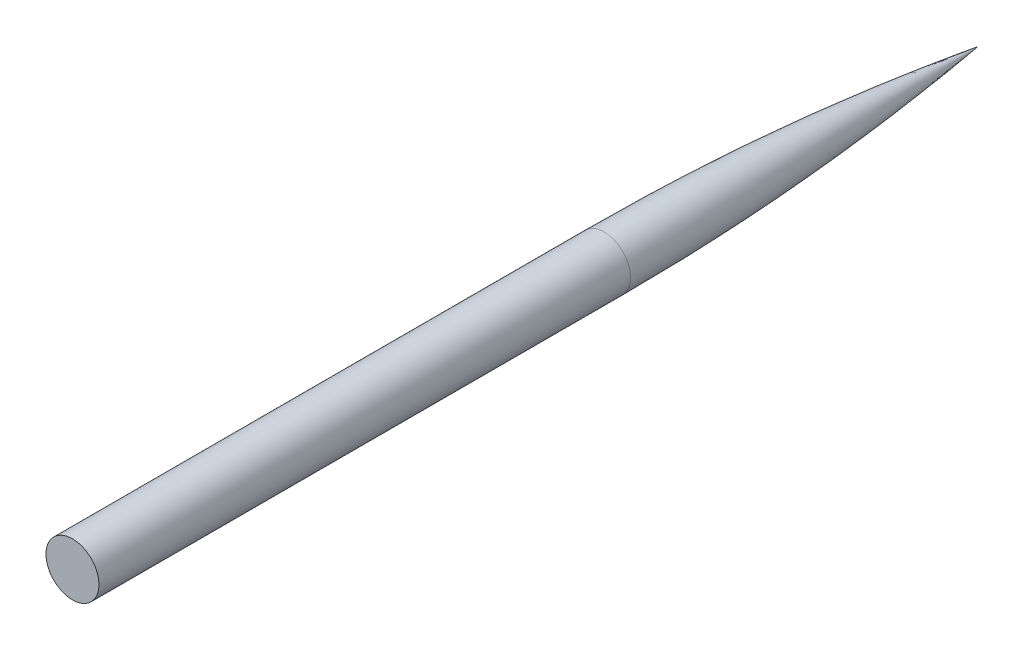
ISO-10303-21;
HEADER;
FILE_DESCRIPTION(('STEP AP214'),'2;1');
FILE_NAME('part.step','',(''),(''),'','','');
FILE_SCHEMA(('AUTOMOTIVE_DESIGN { 1 0 10303 214 1 1 1 1 }'));
ENDSEC;
DATA;
#1=APPLICATION_CONTEXT('core data for automotive mechanical design processes');
#2=APPLICATION_PROTOCOL_DEFINITION('international standard','automotive_design',2000,#1);
#3=PRODUCT_CONTEXT('',#1,'mechanical');
#4=PRODUCT('Part','Part','',(#3));
#5=PRODUCT_RELATED_PRODUCT_CATEGORY('part','',(#4));
#6=PRODUCT_DEFINITION_FORMATION('','',#4);
#7=PRODUCT_DEFINITION_CONTEXT('part definition',#1,'design');
#8=PRODUCT_DEFINITION('design','',#6,#7);
#9=PRODUCT_DEFINITION_SHAPE('','',#8);
#10=(LENGTH_UNIT() NAMED_UNIT(*) SI_UNIT(.MILLI.,.METRE.));
#11=(NAMED_UNIT(*) PLANE_ANGLE_UNIT() SI_UNIT($,.RADIAN.));
#12=(NAMED_UNIT(*) SI_UNIT($,.STERADIAN.) SOLID_ANGLE_UNIT());
#13=UNCERTAINTY_MEASURE_WITH_UNIT(LENGTH_MEASURE(1.E-05),#10,'distance_accuracy_value','');
#14=(GEOMETRIC_REPRESENTATION_CONTEXT(3) GLOBAL_UNCERTAINTY_ASSIGNED_CONTEXT((#13)) GLOBAL_UNIT_ASSIGNED_CONTEXT((#10,
#11,#12)) REPRESENTATION_CONTEXT('',''));
#15=CARTESIAN_POINT('',(0.,0.,0.));
#16=DIRECTION('',(0.,0.,1.));
#17=DIRECTION('',(1.,0.,0.));
#18=AXIS2_PLACEMENT_3D('',#15,#16,#17);
#19=CARTESIAN_POINT('',(0.,0.,-60.1743783956219));
#20=DIRECTION('',(0.,0.,-1.));
#21=DIRECTION('',(-1.,0.,0.));
#22=AXIS2_PLACEMENT_3D('',#19,#20,#21);
#23=CYLINDRICAL_SURFACE('',#22,2.49000000000001);
#24=CARTESIAN_POINT('',(0.,0.,-25.));
#25=DIRECTION('',(0.,0.,-1.));
#26=DIRECTION('',(-1.,0.,0.));
#27=AXIS2_PLACEMENT_3D('',#24,#25,#26);
#28=CIRCLE('',#27,2.49000000000002);
#29=CARTESIAN_POINT('',(-2.49000000000002,0.,-25.));
#30=VERTEX_POINT('',#29);
#31=EDGE_CURVE('E11',#30,#30,#28,.T.);
#32=ORIENTED_EDGE('',*,*,#31,.F.);
#33=EDGE_LOOP('',(#32));
#34=FACE_BOUND('',#33,.T.);
#35=CARTESIAN_POINT('',(0.,0.,25.));
#36=DIRECTION('',(0.,0.,-1.));
#37=DIRECTION('',(-1.,0.,0.));
#38=AXIS2_PLACEMENT_3D('',#35,#36,#37);
#39=CIRCLE('',#38,2.49);
#40=CARTESIAN_POINT('',(-2.49,0.,25.));
#41=VERTEX_POINT('',#40);
#42=EDGE_CURVE('E39',#41,#41,#39,.T.);
#43=ORIENTED_EDGE('',*,*,#42,.T.);
#44=EDGE_LOOP('',(#43));
#45=FACE_BOUND('',#44,.T.);
#46=ADVANCED_FACE('F33',(#34,#45),#23,.T.);
#47=CARTESIAN_POINT('',(247.19614367839,0.,-25.));
#48=DIRECTION('',(0.,-1.,0.));
#49=DIRECTION('',(-1.,0.,0.));
#50=AXIS2_PLACEMENT_3D('',#47,#48,#49);
#51=CIRCLE('',#50,249.68614367839);
#52=TRIMMED_CURVE('',#51,(PARAMETER_VALUE(-0.141344537680216)),
(PARAMETER_VALUE(0.141344537680216)),.T.,.PARAMETER.);
#53=CARTESIAN_POINT('',(0.,0.,-25.));
#54=DIRECTION('',(0.,0.,-1.));
#55=AXIS1_PLACEMENT('',#53,#54);
#56=SURFACE_OF_REVOLUTION('',#52,#55);
#57=CARTESIAN_POINT('',(0.,0.,-60.1743783956219));
#58=VERTEX_POINT('',#57);
#59=VERTEX_LOOP('',#58);
#60=FACE_BOUND('',#59,.T.);
#61=ORIENTED_EDGE('',*,*,#31,.T.);
#62=EDGE_LOOP('',(#61));
#63=FACE_BOUND('',#62,.T.);
#64=ADVANCED_FACE('F42',(#60,#63),#56,.T.);
#65=CARTESIAN_POINT('',(0.,0.,25.));
#66=DIRECTION('',(0.,0.,-1.));
#67=DIRECTION('',(-1.,0.,0.));
#68=AXIS2_PLACEMENT_3D('',#65,#66,#67);
#69=PLANE('',#68);
#70=ORIENTED_EDGE('',*,*,#42,.F.);
#71=EDGE_LOOP('',(#70));
#72=FACE_BOUND('',#71,.T.);
#73=ADVANCED_FACE('F45',(#72),#69,.F.);
#74=CLOSED_SHELL('',(#46,#64,#73));
#75=MANIFOLD_SOLID_BREP('B2',#74);
#76=ADVANCED_BREP_SHAPE_REPRESENTATION('',(#18,#75),#14);
#77=SHAPE_DEFINITION_REPRESENTATION(#9,#76);
ENDSEC;
END-ISO-10303-21;
